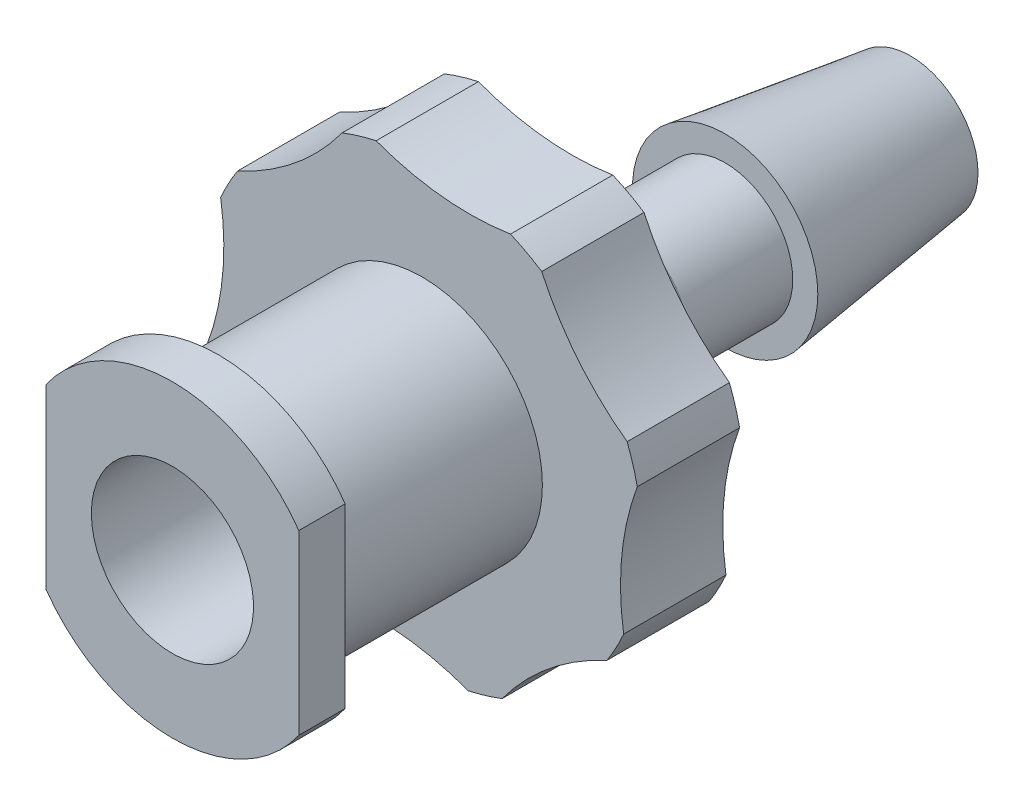
ISO-10303-21;
HEADER;
FILE_DESCRIPTION(('STEP AP214'),'2;1');
FILE_NAME('part.step','',(''),(''),'','','');
FILE_SCHEMA(('AUTOMOTIVE_DESIGN { 1 0 10303 214 1 1 1 1 }'));
ENDSEC;
DATA;
#1=APPLICATION_CONTEXT('core data for automotive mechanical design processes');
#2=APPLICATION_PROTOCOL_DEFINITION('international standard','automotive_design',2000,#1);
#3=PRODUCT_CONTEXT('',#1,'mechanical');
#4=PRODUCT('Part','Part','',(#3));
#5=PRODUCT_RELATED_PRODUCT_CATEGORY('part','',(#4));
#6=PRODUCT_DEFINITION_FORMATION('','',#4);
#7=PRODUCT_DEFINITION_CONTEXT('part definition',#1,'design');
#8=PRODUCT_DEFINITION('design','',#6,#7);
#9=PRODUCT_DEFINITION_SHAPE('','',#8);
#10=(LENGTH_UNIT() NAMED_UNIT(*) SI_UNIT(.MILLI.,.METRE.));
#11=(NAMED_UNIT(*) PLANE_ANGLE_UNIT() SI_UNIT($,.RADIAN.));
#12=(NAMED_UNIT(*) SI_UNIT($,.STERADIAN.) SOLID_ANGLE_UNIT());
#13=UNCERTAINTY_MEASURE_WITH_UNIT(LENGTH_MEASURE(1.E-05),#10,'distance_accuracy_value','');
#14=(GEOMETRIC_REPRESENTATION_CONTEXT(3) GLOBAL_UNCERTAINTY_ASSIGNED_CONTEXT((#13)) GLOBAL_UNIT_ASSIGNED_CONTEXT((#10,
#11,#12)) REPRESENTATION_CONTEXT('',''));
#15=CARTESIAN_POINT('',(0.,0.,0.));
#16=DIRECTION('',(0.,0.,1.));
#17=DIRECTION('',(1.,0.,0.));
#18=AXIS2_PLACEMENT_3D('',#15,#16,#17);
#19=CARTESIAN_POINT('',(0.,0.,0.));
#20=DIRECTION('',(0.,0.,1.));
#21=DIRECTION('',(1.,0.,0.));
#22=AXIS2_PLACEMENT_3D('',#19,#20,#21);
#23=PLANE('',#22);
#24=CARTESIAN_POINT('',(0.,0.,0.));
#25=DIRECTION('',(0.,0.,1.));
#26=DIRECTION('',(1.,0.,0.));
#27=AXIS2_PLACEMENT_3D('',#24,#25,#26);
#28=CIRCLE('',#27,1.215);
#29=CARTESIAN_POINT('',(1.215,0.,0.));
#30=VERTEX_POINT('',#29);
#31=EDGE_CURVE('E301',#30,#30,#28,.T.);
#32=ORIENTED_EDGE('',*,*,#31,.T.);
#33=EDGE_LOOP('',(#32));
#34=FACE_BOUND('',#33,.T.);
#35=CARTESIAN_POINT('',(0.,0.,0.));
#36=DIRECTION('',(0.,0.,1.));
#37=DIRECTION('',(1.,0.,0.));
#38=AXIS2_PLACEMENT_3D('',#35,#36,#37);
#39=CIRCLE('',#38,1.74999999999592);
#40=CARTESIAN_POINT('',(1.74999999999592,0.,0.));
#41=VERTEX_POINT('',#40);
#42=EDGE_CURVE('E23',#41,#41,#39,.T.);
#43=ORIENTED_EDGE('',*,*,#42,.F.);
#44=EDGE_LOOP('',(#43));
#45=FACE_BOUND('',#44,.T.);
#46=ADVANCED_FACE('F20',(#34,#45),#23,.F.);
#47=CARTESIAN_POINT('',(0.,0.,4.79999999981828));
#48=DIRECTION('',(0.,0.,1.));
#49=DIRECTION('',(1.,0.,0.));
#50=AXIS2_PLACEMENT_3D('',#47,#48,#49);
#51=CONICAL_SURFACE('',#50,2.39999999996598,0.134597914159376);
#52=ORIENTED_EDGE('',*,*,#42,.T.);
#53=EDGE_LOOP('',(#52));
#54=FACE_BOUND('',#53,.T.);
#55=CARTESIAN_POINT('',(0.,0.,4.79999999998881));
#56=DIRECTION('',(0.,0.,1.));
#57=DIRECTION('',(1.,0.,0.));
#58=AXIS2_PLACEMENT_3D('',#55,#56,#57);
#59=CIRCLE('',#58,2.39999999998908);
#60=CARTESIAN_POINT('',(2.39999999998908,0.,4.79999999998881));
#61=VERTEX_POINT('',#60);
#62=EDGE_CURVE('E306',#61,#61,#59,.F.);
#63=ORIENTED_EDGE('',*,*,#62,.T.);
#64=EDGE_LOOP('',(#63));
#65=FACE_BOUND('',#64,.T.);
#66=ADVANCED_FACE('F373',(#54,#65),#51,.T.);
#67=CARTESIAN_POINT('',(0.,0.,0.));
#68=DIRECTION('',(0.,0.,1.));
#69=DIRECTION('',(1.,0.,0.));
#70=AXIS2_PLACEMENT_3D('',#67,#68,#69);
#71=CYLINDRICAL_SURFACE('',#70,1.215);
#72=ORIENTED_EDGE('',*,*,#31,.F.);
#73=EDGE_LOOP('',(#72));
#74=FACE_BOUND('',#73,.T.);
#75=CARTESIAN_POINT('',(0.,0.,11.62));
#76=DIRECTION('',(0.,0.,1.));
#77=DIRECTION('',(1.,0.,0.));
#78=AXIS2_PLACEMENT_3D('',#75,#76,#77);
#79=CIRCLE('',#78,1.215);
#80=CARTESIAN_POINT('',(1.215,0.,11.62));
#81=VERTEX_POINT('',#80);
#82=EDGE_CURVE('E310',#81,#81,#79,.F.);
#83=ORIENTED_EDGE('',*,*,#82,.F.);
#84=EDGE_LOOP('',(#83));
#85=FACE_BOUND('',#84,.T.);
#86=ADVANCED_FACE('F382',(#74,#85),#71,.F.);
#87=CARTESIAN_POINT('',(0.,0.,4.8));
#88=DIRECTION('',(0.,0.,-1.));
#89=DIRECTION('',(-1.,0.,0.));
#90=AXIS2_PLACEMENT_3D('',#87,#88,#89);
#91=PLANE('',#90);
#92=CARTESIAN_POINT('',(0.,0.,4.8));
#93=DIRECTION('',(0.,0.,1.));
#94=DIRECTION('',(1.,0.,0.));
#95=AXIS2_PLACEMENT_3D('',#92,#93,#94);
#96=CIRCLE('',#95,1.75);
#97=CARTESIAN_POINT('',(1.75,0.,4.8));
#98=VERTEX_POINT('',#97);
#99=EDGE_CURVE('E313',#98,#98,#96,.T.);
#100=ORIENTED_EDGE('',*,*,#99,.F.);
#101=EDGE_LOOP('',(#100));
#102=FACE_BOUND('',#101,.T.);
#103=ORIENTED_EDGE('',*,*,#62,.F.);
#104=EDGE_LOOP('',(#103));
#105=FACE_BOUND('',#104,.T.);
#106=ADVANCED_FACE('F494',(#102,#105),#91,.F.);
#107=CARTESIAN_POINT('',(0.,0.,11.62));
#108=DIRECTION('',(0.,0.,1.));
#109=DIRECTION('',(1.,0.,0.));
#110=AXIS2_PLACEMENT_3D('',#107,#108,#109);
#111=PLANE('',#110);
#112=ORIENTED_EDGE('',*,*,#82,.T.);
#113=EDGE_LOOP('',(#112));
#114=FACE_BOUND('',#113,.T.);
#115=CARTESIAN_POINT('',(0.,0.,11.62));
#116=DIRECTION('',(0.,0.,-1.));
#117=DIRECTION('',(-1.,0.,0.));
#118=AXIS2_PLACEMENT_3D('',#115,#116,#117);
#119=CIRCLE('',#118,2.1);
#120=CARTESIAN_POINT('',(-2.1,0.,11.62));
#121=VERTEX_POINT('',#120);
#122=EDGE_CURVE('E290',#121,#121,#119,.F.);
#123=ORIENTED_EDGE('',*,*,#122,.T.);
#124=EDGE_LOOP('',(#123));
#125=FACE_BOUND('',#124,.T.);
#126=ADVANCED_FACE('F490',(#114,#125),#111,.T.);
#127=CARTESIAN_POINT('',(0.,0.,0.));
#128=DIRECTION('',(0.,0.,1.));
#129=DIRECTION('',(1.,0.,0.));
#130=AXIS2_PLACEMENT_3D('',#127,#128,#129);
#131=CYLINDRICAL_SURFACE('',#130,1.75);
#132=ORIENTED_EDGE('',*,*,#99,.T.);
#133=EDGE_LOOP('',(#132));
#134=FACE_BOUND('',#133,.T.);
#135=CARTESIAN_POINT('',(0.,0.,7.49999999999318));
#136=DIRECTION('',(0.,0.,1.));
#137=DIRECTION('',(1.,0.,0.));
#138=AXIS2_PLACEMENT_3D('',#135,#136,#137);
#139=CIRCLE('',#138,1.75000000001546);
#140=CARTESIAN_POINT('',(1.75000000001546,0.,7.49999999999318));
#141=VERTEX_POINT('',#140);
#142=EDGE_CURVE('E285',#141,#141,#139,.T.);
#143=ORIENTED_EDGE('',*,*,#142,.F.);
#144=EDGE_LOOP('',(#143));
#145=FACE_BOUND('',#144,.T.);
#146=ADVANCED_FACE('F486',(#134,#145),#131,.T.);
#147=CARTESIAN_POINT('',(0.,0.,19.12));
#148=DIRECTION('',(0.,0.,-1.));
#149=DIRECTION('',(-1.,0.,0.));
#150=AXIS2_PLACEMENT_3D('',#147,#148,#149);
#151=CYLINDRICAL_SURFACE('',#150,2.1);
#152=CARTESIAN_POINT('',(0.,0.,19.12));
#153=DIRECTION('',(0.,0.,-1.));
#154=DIRECTION('',(-1.,0.,0.));
#155=AXIS2_PLACEMENT_3D('',#152,#153,#154);
#156=CIRCLE('',#155,2.1);
#157=CARTESIAN_POINT('',(-2.1,0.,19.12));
#158=VERTEX_POINT('',#157);
#159=EDGE_CURVE('E289',#158,#158,#156,.T.);
#160=ORIENTED_EDGE('',*,*,#159,.F.);
#161=EDGE_LOOP('',(#160));
#162=FACE_BOUND('',#161,.T.);
#163=ORIENTED_EDGE('',*,*,#122,.F.);
#164=EDGE_LOOP('',(#163));
#165=FACE_BOUND('',#164,.T.);
#166=ADVANCED_FACE('F482',(#162,#165),#151,.F.);
#167=CARTESIAN_POINT('',(0.,0.,9.99999999999091));
#168=DIRECTION('',(0.,0.,1.));
#169=DIRECTION('',(1.,0.,0.));
#170=AXIS2_PLACEMENT_3D('',#167,#168,#169);
#171=CONICAL_SURFACE('',#170,2.35000000002117,0.235544980723228);
#172=ORIENTED_EDGE('',*,*,#142,.T.);
#173=EDGE_LOOP('',(#172));
#174=FACE_BOUND('',#173,.T.);
#175=CARTESIAN_POINT('',(0.,0.,9.99999999999091));
#176=DIRECTION('',(0.,0.,1.));
#177=DIRECTION('',(1.,0.,0.));
#178=AXIS2_PLACEMENT_3D('',#175,#176,#177);
#179=CIRCLE('',#178,2.35000000002117);
#180=CARTESIAN_POINT('',(2.35000000002117,0.,9.99999999999091));
#181=VERTEX_POINT('',#180);
#182=EDGE_CURVE('E334',#181,#181,#179,.F.);
#183=ORIENTED_EDGE('',*,*,#182,.T.);
#184=EDGE_LOOP('',(#183));
#185=FACE_BOUND('',#184,.T.);
#186=ADVANCED_FACE('F478',(#174,#185),#171,.T.);
#187=CARTESIAN_POINT('',(0.,0.,19.12));
#188=DIRECTION('',(0.,0.,1.));
#189=DIRECTION('',(1.,0.,0.));
#190=AXIS2_PLACEMENT_3D('',#187,#188,#189);
#191=PLANE('',#190);
#192=ORIENTED_EDGE('',*,*,#159,.T.);
#193=EDGE_LOOP('',(#192));
#194=FACE_BOUND('',#193,.T.);
#195=DIRECTION('',(0.,1.,0.));
#196=VECTOR('',#195,1.);
#197=CARTESIAN_POINT('',(-3.275,2.29660074893308,19.12));
#198=LINE('',#197,#196);
#199=CARTESIAN_POINT('',(-3.275,2.29660074893308,19.12));
#200=VERTEX_POINT('',#199);
#201=CARTESIAN_POINT('',(-3.275,-2.29660074893308,19.12));
#202=VERTEX_POINT('',#201);
#203=EDGE_CURVE('E273',#200,#202,#198,.F.);
#204=ORIENTED_EDGE('',*,*,#203,.T.);
#205=CARTESIAN_POINT('',(0.,0.,19.12));
#206=DIRECTION('',(0.,0.,1.));
#207=DIRECTION('',(1.,0.,0.));
#208=AXIS2_PLACEMENT_3D('',#205,#206,#207);
#209=CIRCLE('',#208,4.);
#210=CARTESIAN_POINT('',(3.275,-2.29660074893309,19.12));
#211=VERTEX_POINT('',#210);
#212=EDGE_CURVE('E284',#211,#202,#209,.F.);
#213=ORIENTED_EDGE('',*,*,#212,.F.);
#214=DIRECTION('',(0.,-1.,0.));
#215=VECTOR('',#214,1.);
#216=CARTESIAN_POINT('',(3.275,-2.29660074893309,19.12));
#217=LINE('',#216,#215);
#218=CARTESIAN_POINT('',(3.275,2.29660074893308,19.12));
#219=VERTEX_POINT('',#218);
#220=EDGE_CURVE('E277',#211,#219,#217,.F.);
#221=ORIENTED_EDGE('',*,*,#220,.T.);
#222=CARTESIAN_POINT('',(0.,0.,19.12));
#223=DIRECTION('',(0.,0.,1.));
#224=DIRECTION('',(1.,0.,0.));
#225=AXIS2_PLACEMENT_3D('',#222,#223,#224);
#226=CIRCLE('',#225,4.);
#227=EDGE_CURVE('E274',#200,#219,#226,.F.);
#228=ORIENTED_EDGE('',*,*,#227,.F.);
#229=EDGE_LOOP('',(#204,#213,#221,#228));
#230=FACE_BOUND('',#229,.T.);
#231=ADVANCED_FACE('F475',(#194,#230),#191,.T.);
#232=CARTESIAN_POINT('',(0.,0.,10.));
#233=DIRECTION('',(0.,0.,1.));
#234=DIRECTION('',(1.,0.,0.));
#235=AXIS2_PLACEMENT_3D('',#232,#233,#234);
#236=CYLINDRICAL_SURFACE('',#235,5.7);
#237=DIRECTION('',(0.,0.,1.));
#238=VECTOR('',#237,1.);
#239=CARTESIAN_POINT('',(2.07266928245262,-5.3098062154448,10.));
#240=LINE('',#239,#238);
#241=CARTESIAN_POINT('',(2.07266928245257,-5.30980621544487,10.));
#242=VERTEX_POINT('',#241);
#243=CARTESIAN_POINT('',(2.07266928245257,-5.30980621544487,12.65));
#244=VERTEX_POINT('',#243);
#245=EDGE_CURVE('E172',#242,#244,#240,.T.);
#246=ORIENTED_EDGE('',*,*,#245,.T.);
#247=CARTESIAN_POINT('',(0.,0.,12.65));
#248=DIRECTION('',(0.,0.,1.));
#249=DIRECTION('',(1.,0.,0.));
#250=AXIS2_PLACEMENT_3D('',#247,#248,#249);
#251=CIRCLE('',#250,5.7);
#252=CARTESIAN_POINT('',(1.19309733414147,-5.57373472200319,12.65));
#253=VERTEX_POINT('',#252);
#254=EDGE_CURVE('E84',#244,#253,#251,.F.);
#255=ORIENTED_EDGE('',*,*,#254,.T.);
#256=DIRECTION('',(0.,0.,1.));
#257=VECTOR('',#256,1.);
#258=CARTESIAN_POINT('',(1.19309733414139,-5.57373472200316,10.));
#259=LINE('',#258,#257);
#260=CARTESIAN_POINT('',(1.19309733414147,-5.57373472200319,10.));
#261=VERTEX_POINT('',#260);
#262=EDGE_CURVE('E174',#253,#261,#259,.F.);
#263=ORIENTED_EDGE('',*,*,#262,.T.);
#264=CARTESIAN_POINT('',(0.,0.,10.));
#265=DIRECTION('',(0.,0.,1.));
#266=DIRECTION('',(1.,0.,0.));
#267=AXIS2_PLACEMENT_3D('',#264,#265,#266);
#268=CIRCLE('',#267,5.7);
#269=EDGE_CURVE('E168',#261,#242,#268,.T.);
#270=ORIENTED_EDGE('',*,*,#269,.T.);
#271=EDGE_LOOP('',(#246,#255,#263,#270));
#272=FACE_BOUND('',#271,.T.);
#273=ADVANCED_FACE('F170',(#272),#236,.T.);
#274=CARTESIAN_POINT('',(0.,0.,10.));
#275=DIRECTION('',(0.,0.,1.));
#276=DIRECTION('',(1.,0.,0.));
#277=AXIS2_PLACEMENT_3D('',#274,#275,#276);
#278=CYLINDRICAL_SURFACE('',#277,5.7);
#279=DIRECTION('',(0.,0.,1.));
#280=VECTOR('',#279,1.);
#281=CARTESIAN_POINT('',(4.78487283405032,-3.09757840287638,10.));
#282=LINE('',#281,#280);
#283=CARTESIAN_POINT('',(4.7848728340504,-3.09757840287634,12.65));
#284=VERTEX_POINT('',#283);
#285=CARTESIAN_POINT('',(4.7848728340504,-3.09757840287634,10.));
#286=VERTEX_POINT('',#285);
#287=EDGE_CURVE('E190',#284,#286,#282,.F.);
#288=ORIENTED_EDGE('',*,*,#287,.T.);
#289=CARTESIAN_POINT('',(0.,0.,10.));
#290=DIRECTION('',(0.,0.,1.));
#291=DIRECTION('',(1.,0.,0.));
#292=AXIS2_PLACEMENT_3D('',#289,#290,#291);
#293=CIRCLE('',#292,5.7);
#294=CARTESIAN_POINT('',(5.22019848650682,-2.28900147694827,10.));
#295=VERTEX_POINT('',#294);
#296=EDGE_CURVE('E179',#286,#295,#293,.T.);
#297=ORIENTED_EDGE('',*,*,#296,.T.);
#298=DIRECTION('',(0.,0.,1.));
#299=VECTOR('',#298,1.);
#300=CARTESIAN_POINT('',(5.2201984865068,-2.28900147694819,10.));
#301=LINE('',#300,#299);
#302=CARTESIAN_POINT('',(5.22019848650682,-2.28900147694827,12.65));
#303=VERTEX_POINT('',#302);
#304=EDGE_CURVE('E224',#295,#303,#301,.T.);
#305=ORIENTED_EDGE('',*,*,#304,.T.);
#306=CARTESIAN_POINT('',(0.,0.,12.65));
#307=DIRECTION('',(0.,0.,1.));
#308=DIRECTION('',(1.,0.,0.));
#309=AXIS2_PLACEMENT_3D('',#306,#307,#308);
#310=CIRCLE('',#309,5.7);
#311=EDGE_CURVE('E363',#303,#284,#310,.F.);
#312=ORIENTED_EDGE('',*,*,#311,.T.);
#313=EDGE_LOOP('',(#288,#297,#305,#312));
#314=FACE_BOUND('',#313,.T.);
#315=ADVANCED_FACE('F469',(#314),#278,.T.);
#316=CARTESIAN_POINT('',(0.,0.,10.));
#317=DIRECTION('',(0.,0.,1.));
#318=DIRECTION('',(1.,0.,0.));
#319=AXIS2_PLACEMENT_3D('',#316,#317,#318);
#320=CYLINDRICAL_SURFACE('',#319,5.7);
#321=DIRECTION('',(0.,0.,1.));
#322=VECTOR('',#321,1.);
#323=CARTESIAN_POINT('',(5.3098062154448,2.07266928245263,10.));
#324=LINE('',#323,#322);
#325=CARTESIAN_POINT('',(5.30980621544487,2.07266928245257,10.));
#326=VERTEX_POINT('',#325);
#327=CARTESIAN_POINT('',(5.30980621544487,2.07266928245257,12.65));
#328=VERTEX_POINT('',#327);
#329=EDGE_CURVE('E213',#326,#328,#324,.T.);
#330=ORIENTED_EDGE('',*,*,#329,.T.);
#331=CARTESIAN_POINT('',(0.,0.,12.65));
#332=DIRECTION('',(0.,0.,1.));
#333=DIRECTION('',(1.,0.,0.));
#334=AXIS2_PLACEMENT_3D('',#331,#332,#333);
#335=CIRCLE('',#334,5.7);
#336=CARTESIAN_POINT('',(5.57373472200319,1.19309733414147,12.65));
#337=VERTEX_POINT('',#336);
#338=EDGE_CURVE('E361',#328,#337,#335,.F.);
#339=ORIENTED_EDGE('',*,*,#338,.T.);
#340=DIRECTION('',(0.,0.,1.));
#341=VECTOR('',#340,1.);
#342=CARTESIAN_POINT('',(5.57373472200316,1.19309733414139,10.));
#343=LINE('',#342,#341);
#344=CARTESIAN_POINT('',(5.57373472200319,1.19309733414147,10.));
#345=VERTEX_POINT('',#344);
#346=EDGE_CURVE('E195',#337,#345,#343,.F.);
#347=ORIENTED_EDGE('',*,*,#346,.T.);
#348=CARTESIAN_POINT('',(0.,0.,10.));
#349=DIRECTION('',(0.,0.,1.));
#350=DIRECTION('',(1.,0.,0.));
#351=AXIS2_PLACEMENT_3D('',#348,#349,#350);
#352=CIRCLE('',#351,5.7);
#353=EDGE_CURVE('E345',#345,#326,#352,.T.);
#354=ORIENTED_EDGE('',*,*,#353,.T.);
#355=EDGE_LOOP('',(#330,#339,#347,#354));
#356=FACE_BOUND('',#355,.T.);
#357=ADVANCED_FACE('F465',(#356),#320,.T.);
#358=CARTESIAN_POINT('',(0.,0.,10.));
#359=DIRECTION('',(0.,0.,1.));
#360=DIRECTION('',(1.,0.,0.));
#361=AXIS2_PLACEMENT_3D('',#358,#359,#360);
#362=CYLINDRICAL_SURFACE('',#361,5.7);
#363=DIRECTION('',(0.,0.,1.));
#364=VECTOR('',#363,1.);
#365=CARTESIAN_POINT('',(3.09757840287637,4.78487283405032,10.));
#366=LINE('',#365,#364);
#367=CARTESIAN_POINT('',(3.09757840287634,4.7848728340504,12.65));
#368=VERTEX_POINT('',#367);
#369=CARTESIAN_POINT('',(3.09757840287634,4.7848728340504,10.));
#370=VERTEX_POINT('',#369);
#371=EDGE_CURVE('E222',#368,#370,#366,.F.);
#372=ORIENTED_EDGE('',*,*,#371,.T.);
#373=CARTESIAN_POINT('',(0.,0.,10.));
#374=DIRECTION('',(0.,0.,1.));
#375=DIRECTION('',(1.,0.,0.));
#376=AXIS2_PLACEMENT_3D('',#373,#374,#375);
#377=CIRCLE('',#376,5.7);
#378=CARTESIAN_POINT('',(2.28900147694827,5.22019848650682,10.));
#379=VERTEX_POINT('',#378);
#380=EDGE_CURVE('E342',#370,#379,#377,.T.);
#381=ORIENTED_EDGE('',*,*,#380,.T.);
#382=DIRECTION('',(0.,0.,1.));
#383=VECTOR('',#382,1.);
#384=CARTESIAN_POINT('',(2.28900147694819,5.2201984865068,10.));
#385=LINE('',#384,#383);
#386=CARTESIAN_POINT('',(2.28900147694827,5.22019848650682,12.65));
#387=VERTEX_POINT('',#386);
#388=EDGE_CURVE('E231',#379,#387,#385,.T.);
#389=ORIENTED_EDGE('',*,*,#388,.T.);
#390=CARTESIAN_POINT('',(0.,0.,12.65));
#391=DIRECTION('',(0.,0.,1.));
#392=DIRECTION('',(1.,0.,0.));
#393=AXIS2_PLACEMENT_3D('',#390,#391,#392);
#394=CIRCLE('',#393,5.7);
#395=EDGE_CURVE('E358',#387,#368,#394,.F.);
#396=ORIENTED_EDGE('',*,*,#395,.T.);
#397=EDGE_LOOP('',(#372,#381,#389,#396));
#398=FACE_BOUND('',#397,.T.);
#399=ADVANCED_FACE('F461',(#398),#362,.T.);
#400=CARTESIAN_POINT('',(0.,0.,10.));
#401=DIRECTION('',(0.,0.,1.));
#402=DIRECTION('',(1.,0.,0.));
#403=AXIS2_PLACEMENT_3D('',#400,#401,#402);
#404=CYLINDRICAL_SURFACE('',#403,5.7);
#405=DIRECTION('',(0.,0.,1.));
#406=VECTOR('',#405,1.);
#407=CARTESIAN_POINT('',(-2.07266928245263,5.3098062154448,10.));
#408=LINE('',#407,#406);
#409=CARTESIAN_POINT('',(-2.07266928245257,5.30980621544487,10.));
#410=VERTEX_POINT('',#409);
#411=CARTESIAN_POINT('',(-2.07266928245257,5.30980621544487,12.65));
#412=VERTEX_POINT('',#411);
#413=EDGE_CURVE('E240',#410,#412,#408,.T.);
#414=ORIENTED_EDGE('',*,*,#413,.T.);
#415=CARTESIAN_POINT('',(0.,0.,12.65));
#416=DIRECTION('',(0.,0.,1.));
#417=DIRECTION('',(1.,0.,0.));
#418=AXIS2_PLACEMENT_3D('',#415,#416,#417);
#419=CIRCLE('',#418,5.7);
#420=CARTESIAN_POINT('',(-1.19309733414147,5.57373472200319,12.65));
#421=VERTEX_POINT('',#420);
#422=EDGE_CURVE('E355',#412,#421,#419,.F.);
#423=ORIENTED_EDGE('',*,*,#422,.T.);
#424=DIRECTION('',(0.,0.,1.));
#425=VECTOR('',#424,1.);
#426=CARTESIAN_POINT('',(-1.19309733414139,5.57373472200316,10.));
#427=LINE('',#426,#425);
#428=CARTESIAN_POINT('',(-1.19309733414147,5.57373472200319,10.));
#429=VERTEX_POINT('',#428);
#430=EDGE_CURVE('E219',#421,#429,#427,.F.);
#431=ORIENTED_EDGE('',*,*,#430,.T.);
#432=CARTESIAN_POINT('',(0.,0.,10.));
#433=DIRECTION('',(0.,0.,1.));
#434=DIRECTION('',(1.,0.,0.));
#435=AXIS2_PLACEMENT_3D('',#432,#433,#434);
#436=CIRCLE('',#435,5.7);
#437=EDGE_CURVE('E339',#429,#410,#436,.T.);
#438=ORIENTED_EDGE('',*,*,#437,.T.);
#439=EDGE_LOOP('',(#414,#423,#431,#438));
#440=FACE_BOUND('',#439,.T.);
#441=ADVANCED_FACE('F457',(#440),#404,.T.);
#442=CARTESIAN_POINT('',(0.,0.,10.));
#443=DIRECTION('',(0.,0.,1.));
#444=DIRECTION('',(1.,0.,0.));
#445=AXIS2_PLACEMENT_3D('',#442,#443,#444);
#446=CYLINDRICAL_SURFACE('',#445,5.7);
#447=DIRECTION('',(0.,0.,1.));
#448=VECTOR('',#447,1.);
#449=CARTESIAN_POINT('',(-4.78487283405032,3.09757840287637,10.));
#450=LINE('',#449,#448);
#451=CARTESIAN_POINT('',(-4.7848728340504,3.09757840287634,12.65));
#452=VERTEX_POINT('',#451);
#453=CARTESIAN_POINT('',(-4.7848728340504,3.09757840287634,10.));
#454=VERTEX_POINT('',#453);
#455=EDGE_CURVE('E236',#452,#454,#450,.F.);
#456=ORIENTED_EDGE('',*,*,#455,.T.);
#457=CARTESIAN_POINT('',(0.,0.,10.));
#458=DIRECTION('',(0.,0.,1.));
#459=DIRECTION('',(1.,0.,0.));
#460=AXIS2_PLACEMENT_3D('',#457,#458,#459);
#461=CIRCLE('',#460,5.7);
#462=CARTESIAN_POINT('',(-5.22019848650682,2.28900147694828,10.));
#463=VERTEX_POINT('',#462);
#464=EDGE_CURVE('E335',#454,#463,#461,.T.);
#465=ORIENTED_EDGE('',*,*,#464,.T.);
#466=DIRECTION('',(0.,0.,1.));
#467=VECTOR('',#466,1.);
#468=CARTESIAN_POINT('',(-5.22019848650681,2.28900147694819,10.));
#469=LINE('',#468,#467);
#470=CARTESIAN_POINT('',(-5.22019848650682,2.28900147694828,12.65));
#471=VERTEX_POINT('',#470);
#472=EDGE_CURVE('E249',#463,#471,#469,.T.);
#473=ORIENTED_EDGE('',*,*,#472,.T.);
#474=CARTESIAN_POINT('',(0.,0.,12.65));
#475=DIRECTION('',(0.,0.,1.));
#476=DIRECTION('',(1.,0.,0.));
#477=AXIS2_PLACEMENT_3D('',#474,#475,#476);
#478=CIRCLE('',#477,5.7);
#479=EDGE_CURVE('E352',#471,#452,#478,.F.);
#480=ORIENTED_EDGE('',*,*,#479,.T.);
#481=EDGE_LOOP('',(#456,#465,#473,#480));
#482=FACE_BOUND('',#481,.T.);
#483=ADVANCED_FACE('F454',(#482),#446,.T.);
#484=CARTESIAN_POINT('',(0.,0.,10.));
#485=DIRECTION('',(0.,0.,1.));
#486=DIRECTION('',(1.,0.,0.));
#487=AXIS2_PLACEMENT_3D('',#484,#485,#486);
#488=CYLINDRICAL_SURFACE('',#487,5.7);
#489=DIRECTION('',(0.,0.,1.));
#490=VECTOR('',#489,1.);
#491=CARTESIAN_POINT('',(-3.09757840287637,-4.78487283405032,10.));
#492=LINE('',#491,#490);
#493=CARTESIAN_POINT('',(-3.09757840287633,-4.7848728340504,12.65));
#494=VERTEX_POINT('',#493);
#495=CARTESIAN_POINT('',(-3.09757840287633,-4.7848728340504,10.));
#496=VERTEX_POINT('',#495);
#497=EDGE_CURVE('E254',#494,#496,#492,.F.);
#498=ORIENTED_EDGE('',*,*,#497,.T.);
#499=CARTESIAN_POINT('',(0.,0.,10.));
#500=DIRECTION('',(0.,0.,1.));
#501=DIRECTION('',(1.,0.,0.));
#502=AXIS2_PLACEMENT_3D('',#499,#500,#501);
#503=CIRCLE('',#502,5.7);
#504=CARTESIAN_POINT('',(-2.28900147694828,-5.22019848650682,10.));
#505=VERTEX_POINT('',#504);
#506=EDGE_CURVE('E329',#496,#505,#503,.T.);
#507=ORIENTED_EDGE('',*,*,#506,.T.);
#508=DIRECTION('',(0.,0.,1.));
#509=VECTOR('',#508,1.);
#510=CARTESIAN_POINT('',(-2.28900147694819,-5.2201984865068,10.));
#511=LINE('',#510,#509);
#512=CARTESIAN_POINT('',(-2.28900147694828,-5.22019848650682,12.65));
#513=VERTEX_POINT('',#512);
#514=EDGE_CURVE('E769',#505,#513,#511,.T.);
#515=ORIENTED_EDGE('',*,*,#514,.T.);
#516=CARTESIAN_POINT('',(0.,0.,12.65));
#517=DIRECTION('',(0.,0.,1.));
#518=DIRECTION('',(1.,0.,0.));
#519=AXIS2_PLACEMENT_3D('',#516,#517,#518);
#520=CIRCLE('',#519,5.7);
#521=EDGE_CURVE('E40',#513,#494,#520,.F.);
#522=ORIENTED_EDGE('',*,*,#521,.T.);
#523=EDGE_LOOP('',(#498,#507,#515,#522));
#524=FACE_BOUND('',#523,.T.);
#525=ADVANCED_FACE('F450',(#524),#488,.T.);
#526=CARTESIAN_POINT('',(0.,0.,10.));
#527=DIRECTION('',(0.,0.,1.));
#528=DIRECTION('',(1.,0.,0.));
#529=AXIS2_PLACEMENT_3D('',#526,#527,#528);
#530=PLANE('',#529);
#531=ORIENTED_EDGE('',*,*,#182,.F.);
#532=EDGE_LOOP('',(#531));
#533=FACE_BOUND('',#532,.T.);
#534=ORIENTED_EDGE('',*,*,#506,.F.);
#535=CARTESIAN_POINT('',(-9.3971147015417,-7.66482238709559,10.));
#536=DIRECTION('',(0.,0.,1.));
#537=DIRECTION('',(1.,0.,0.));
#538=AXIS2_PLACEMENT_3D('',#535,#536,#537);
#539=CIRCLE('',#538,6.92663460897771);
#540=CARTESIAN_POINT('',(-5.30980621544487,-2.07266928245256,10.));
#541=VERTEX_POINT('',#540);
#542=EDGE_CURVE('E257',#496,#541,#539,.T.);
#543=ORIENTED_EDGE('',*,*,#542,.T.);
#544=CARTESIAN_POINT('',(0.,0.,10.));
#545=DIRECTION('',(0.,0.,1.));
#546=DIRECTION('',(1.,0.,0.));
#547=AXIS2_PLACEMENT_3D('',#544,#545,#546);
#548=CIRCLE('',#547,5.7);
#549=CARTESIAN_POINT('',(-5.57373472200322,-1.19309733414156,10.));
#550=VERTEX_POINT('',#549);
#551=EDGE_CURVE('E753',#550,#541,#548,.T.);
#552=ORIENTED_EDGE('',*,*,#551,.F.);
#553=CARTESIAN_POINT('',(-12.0646114155537,1.22491564254219,10.));
#554=DIRECTION('',(0.,0.,1.));
#555=DIRECTION('',(1.,0.,0.));
#556=AXIS2_PLACEMENT_3D('',#553,#554,#555);
#557=CIRCLE('',#556,6.92663460897771);
#558=EDGE_CURVE('E248',#550,#463,#557,.T.);
#559=ORIENTED_EDGE('',*,*,#558,.T.);
#560=ORIENTED_EDGE('',*,*,#464,.F.);
#561=CARTESIAN_POINT('',(-7.66482238709559,9.39711470154171,10.));
#562=DIRECTION('',(0.,0.,1.));
#563=DIRECTION('',(1.,0.,0.));
#564=AXIS2_PLACEMENT_3D('',#561,#562,#563);
#565=CIRCLE('',#564,6.92663460897771);
#566=EDGE_CURVE('E239',#454,#410,#565,.T.);
#567=ORIENTED_EDGE('',*,*,#566,.T.);
#568=ORIENTED_EDGE('',*,*,#437,.F.);
#569=CARTESIAN_POINT('',(1.22491564254219,12.0646114155537,10.));
#570=DIRECTION('',(0.,0.,1.));
#571=DIRECTION('',(1.,0.,0.));
#572=AXIS2_PLACEMENT_3D('',#569,#570,#571);
#573=CIRCLE('',#572,6.92663460897771);
#574=EDGE_CURVE('E237',#429,#379,#573,.T.);
#575=ORIENTED_EDGE('',*,*,#574,.T.);
#576=ORIENTED_EDGE('',*,*,#380,.F.);
#577=CARTESIAN_POINT('',(9.39711470154171,7.66482238709559,10.));
#578=DIRECTION('',(0.,0.,1.));
#579=DIRECTION('',(1.,0.,0.));
#580=AXIS2_PLACEMENT_3D('',#577,#578,#579);
#581=CIRCLE('',#580,6.92663460897771);
#582=EDGE_CURVE('E220',#370,#326,#581,.T.);
#583=ORIENTED_EDGE('',*,*,#582,.T.);
#584=ORIENTED_EDGE('',*,*,#353,.F.);
#585=CARTESIAN_POINT('',(12.0646114155537,-1.22491564254219,10.));
#586=DIRECTION('',(0.,0.,1.));
#587=DIRECTION('',(1.,0.,0.));
#588=AXIS2_PLACEMENT_3D('',#585,#586,#587);
#589=CIRCLE('',#588,6.92663460897771);
#590=EDGE_CURVE('E199',#345,#295,#589,.T.);
#591=ORIENTED_EDGE('',*,*,#590,.T.);
#592=ORIENTED_EDGE('',*,*,#296,.F.);
#593=CARTESIAN_POINT('',(7.66482238709559,-9.39711470154171,10.));
#594=DIRECTION('',(0.,0.,1.));
#595=DIRECTION('',(1.,0.,0.));
#596=AXIS2_PLACEMENT_3D('',#593,#594,#595);
#597=CIRCLE('',#596,6.92663460897771);
#598=EDGE_CURVE('E183',#286,#242,#597,.T.);
#599=ORIENTED_EDGE('',*,*,#598,.T.);
#600=ORIENTED_EDGE('',*,*,#269,.F.);
#601=CARTESIAN_POINT('',(-1.22491564254219,-12.0646114155537,10.));
#602=DIRECTION('',(0.,0.,1.));
#603=DIRECTION('',(1.,0.,0.));
#604=AXIS2_PLACEMENT_3D('',#601,#602,#603);
#605=CIRCLE('',#604,6.92663460897771);
#606=EDGE_CURVE('E767',#261,#505,#605,.T.);
#607=ORIENTED_EDGE('',*,*,#606,.T.);
#608=EDGE_LOOP('',(#534,#543,#552,#559,#560,#567,#568,#575,#576,#583,#584,#591,#592,#599,#600,#607));
#609=FACE_BOUND('',#608,.T.);
#610=ADVANCED_FACE('F185',(#533,#609),#530,.F.);
#611=CARTESIAN_POINT('',(0.,0.,10.));
#612=DIRECTION('',(0.,0.,1.));
#613=DIRECTION('',(1.,0.,0.));
#614=AXIS2_PLACEMENT_3D('',#611,#612,#613);
#615=CYLINDRICAL_SURFACE('',#614,5.7);
#616=DIRECTION('',(0.,0.,1.));
#617=VECTOR('',#616,1.);
#618=CARTESIAN_POINT('',(-5.3098062154448,-2.07266928245262,10.));
#619=LINE('',#618,#617);
#620=CARTESIAN_POINT('',(-5.30980621544487,-2.07266928245256,12.65));
#621=VERTEX_POINT('',#620);
#622=EDGE_CURVE('E258',#541,#621,#619,.T.);
#623=ORIENTED_EDGE('',*,*,#622,.T.);
#624=CARTESIAN_POINT('',(0.,0.,12.65));
#625=DIRECTION('',(0.,0.,1.));
#626=DIRECTION('',(1.,0.,0.));
#627=AXIS2_PLACEMENT_3D('',#624,#625,#626);
#628=CIRCLE('',#627,5.7);
#629=CARTESIAN_POINT('',(-5.57373472200322,-1.19309733414156,12.65));
#630=VERTEX_POINT('',#629);
#631=EDGE_CURVE('E756',#621,#630,#628,.F.);
#632=ORIENTED_EDGE('',*,*,#631,.T.);
#633=DIRECTION('',(0.,0.,1.));
#634=VECTOR('',#633,1.);
#635=CARTESIAN_POINT('',(-5.57373472200322,-1.19309733414156,10.));
#636=LINE('',#635,#634);
#637=EDGE_CURVE('E245',#630,#550,#636,.F.);
#638=ORIENTED_EDGE('',*,*,#637,.T.);
#639=ORIENTED_EDGE('',*,*,#551,.T.);
#640=EDGE_LOOP('',(#623,#632,#638,#639));
#641=FACE_BOUND('',#640,.T.);
#642=ADVANCED_FACE('F443',(#641),#615,.T.);
#643=CARTESIAN_POINT('',(0.,0.,17.92));
#644=DIRECTION('',(0.,0.,1.));
#645=DIRECTION('',(1.,0.,0.));
#646=AXIS2_PLACEMENT_3D('',#643,#644,#645);
#647=CYLINDRICAL_SURFACE('',#646,4.);
#648=DIRECTION('',(0.,0.,1.));
#649=VECTOR('',#648,1.);
#650=CARTESIAN_POINT('',(-3.275,2.29660074893308,19.12));
#651=LINE('',#650,#649);
#652=CARTESIAN_POINT('',(-3.275,2.29660074893308,17.92));
#653=VERTEX_POINT('',#652);
#654=EDGE_CURVE('E267',#653,#200,#651,.T.);
#655=ORIENTED_EDGE('',*,*,#654,.T.);
#656=ORIENTED_EDGE('',*,*,#227,.T.);
#657=DIRECTION('',(0.,0.,1.));
#658=VECTOR('',#657,1.);
#659=CARTESIAN_POINT('',(3.275,2.29660074893308,19.12));
#660=LINE('',#659,#658);
#661=CARTESIAN_POINT('',(3.275,2.29660074893308,17.92));
#662=VERTEX_POINT('',#661);
#663=EDGE_CURVE('E280',#219,#662,#660,.F.);
#664=ORIENTED_EDGE('',*,*,#663,.T.);
#665=CARTESIAN_POINT('',(0.,0.,17.92));
#666=DIRECTION('',(0.,0.,1.));
#667=DIRECTION('',(1.,0.,0.));
#668=AXIS2_PLACEMENT_3D('',#665,#666,#667);
#669=CIRCLE('',#668,4.);
#670=EDGE_CURVE('E263',#662,#653,#669,.T.);
#671=ORIENTED_EDGE('',*,*,#670,.T.);
#672=EDGE_LOOP('',(#655,#656,#664,#671));
#673=FACE_BOUND('',#672,.T.);
#674=ADVANCED_FACE('F439',(#673),#647,.T.);
#675=CARTESIAN_POINT('',(-3.275,2.29660074893308,19.12));
#676=DIRECTION('',(1.,0.,0.));
#677=DIRECTION('',(0.,1.,0.));
#678=AXIS2_PLACEMENT_3D('',#675,#676,#677);
#679=PLANE('',#678);
#680=DIRECTION('',(0.,0.,1.));
#681=VECTOR('',#680,1.);
#682=CARTESIAN_POINT('',(-3.275,-2.29660074893308,17.92));
#683=LINE('',#682,#681);
#684=CARTESIAN_POINT('',(-3.275,-2.29660074893308,17.92));
#685=VERTEX_POINT('',#684);
#686=EDGE_CURVE('E275',#202,#685,#683,.F.);
#687=ORIENTED_EDGE('',*,*,#686,.F.);
#688=ORIENTED_EDGE('',*,*,#203,.F.);
#689=ORIENTED_EDGE('',*,*,#654,.F.);
#690=DIRECTION('',(0.,1.,0.));
#691=VECTOR('',#690,1.);
#692=CARTESIAN_POINT('',(-3.275,0.,17.92));
#693=LINE('',#692,#691);
#694=EDGE_CURVE('E264',#653,#685,#693,.F.);
#695=ORIENTED_EDGE('',*,*,#694,.T.);
#696=EDGE_LOOP('',(#687,#688,#689,#695));
#697=FACE_BOUND('',#696,.T.);
#698=ADVANCED_FACE('F436',(#697),#679,.F.);
#699=CARTESIAN_POINT('',(0.,0.,17.92));
#700=DIRECTION('',(0.,0.,1.));
#701=DIRECTION('',(1.,0.,0.));
#702=AXIS2_PLACEMENT_3D('',#699,#700,#701);
#703=CYLINDRICAL_SURFACE('',#702,4.);
#704=ORIENTED_EDGE('',*,*,#686,.T.);
#705=CARTESIAN_POINT('',(0.,0.,17.92));
#706=DIRECTION('',(0.,0.,1.));
#707=DIRECTION('',(1.,0.,0.));
#708=AXIS2_PLACEMENT_3D('',#705,#706,#707);
#709=CIRCLE('',#708,4.);
#710=CARTESIAN_POINT('',(3.275,-2.29660074893309,17.92));
#711=VERTEX_POINT('',#710);
#712=EDGE_CURVE('E98',#685,#711,#709,.T.);
#713=ORIENTED_EDGE('',*,*,#712,.T.);
#714=DIRECTION('',(0.,0.,1.));
#715=VECTOR('',#714,1.);
#716=CARTESIAN_POINT('',(3.275,-2.29660074893309,19.12));
#717=LINE('',#716,#715);
#718=EDGE_CURVE('E281',#711,#211,#717,.T.);
#719=ORIENTED_EDGE('',*,*,#718,.T.);
#720=ORIENTED_EDGE('',*,*,#212,.T.);
#721=EDGE_LOOP('',(#704,#713,#719,#720));
#722=FACE_BOUND('',#721,.T.);
#723=ADVANCED_FACE('F432',(#722),#703,.T.);
#724=CARTESIAN_POINT('',(3.275,-2.29660074893309,19.12));
#725=DIRECTION('',(-1.,0.,0.));
#726=DIRECTION('',(0.,-1.,0.));
#727=AXIS2_PLACEMENT_3D('',#724,#725,#726);
#728=PLANE('',#727);
#729=ORIENTED_EDGE('',*,*,#663,.F.);
#730=ORIENTED_EDGE('',*,*,#220,.F.);
#731=ORIENTED_EDGE('',*,*,#718,.F.);
#732=DIRECTION('',(0.,1.,0.));
#733=VECTOR('',#732,1.);
#734=CARTESIAN_POINT('',(3.275,0.,17.92));
#735=LINE('',#734,#733);
#736=EDGE_CURVE('E791',#711,#662,#735,.T.);
#737=ORIENTED_EDGE('',*,*,#736,.T.);
#738=EDGE_LOOP('',(#729,#730,#731,#737));
#739=FACE_BOUND('',#738,.T.);
#740=ADVANCED_FACE('F428',(#739),#728,.F.);
#741=CARTESIAN_POINT('',(-1.22491564254219,-12.0646114155537,10.));
#742=DIRECTION('',(0.,0.,1.));
#743=DIRECTION('',(1.,0.,0.));
#744=AXIS2_PLACEMENT_3D('',#741,#742,#743);
#745=CYLINDRICAL_SURFACE('',#744,6.92663460897771);
#746=ORIENTED_EDGE('',*,*,#514,.F.);
#747=ORIENTED_EDGE('',*,*,#606,.F.);
#748=ORIENTED_EDGE('',*,*,#262,.F.);
#749=CARTESIAN_POINT('',(-1.22491564254219,-12.0646114155537,12.65));
#750=DIRECTION('',(0.,0.,1.));
#751=DIRECTION('',(1.,0.,0.));
#752=AXIS2_PLACEMENT_3D('',#749,#750,#751);
#753=CIRCLE('',#752,6.92663460897771);
#754=EDGE_CURVE('E792',#513,#253,#753,.F.);
#755=ORIENTED_EDGE('',*,*,#754,.F.);
#756=EDGE_LOOP('',(#746,#747,#748,#755));
#757=FACE_BOUND('',#756,.T.);
#758=ADVANCED_FACE('F425',(#757),#745,.F.);
#759=CARTESIAN_POINT('',(7.66482238709559,-9.39711470154171,10.));
#760=DIRECTION('',(0.,0.,1.));
#761=DIRECTION('',(1.,0.,0.));
#762=AXIS2_PLACEMENT_3D('',#759,#760,#761);
#763=CYLINDRICAL_SURFACE('',#762,6.92663460897771);
#764=ORIENTED_EDGE('',*,*,#245,.F.);
#765=ORIENTED_EDGE('',*,*,#598,.F.);
#766=ORIENTED_EDGE('',*,*,#287,.F.);
#767=CARTESIAN_POINT('',(7.66482238709559,-9.39711470154171,12.65));
#768=DIRECTION('',(0.,0.,1.));
#769=DIRECTION('',(1.,0.,0.));
#770=AXIS2_PLACEMENT_3D('',#767,#768,#769);
#771=CIRCLE('',#770,6.92663460897771);
#772=EDGE_CURVE('E193',#244,#284,#771,.F.);
#773=ORIENTED_EDGE('',*,*,#772,.F.);
#774=EDGE_LOOP('',(#764,#765,#766,#773));
#775=FACE_BOUND('',#774,.T.);
#776=ADVANCED_FACE('F192',(#775),#763,.F.);
#777=CARTESIAN_POINT('',(12.0646114155537,-1.22491564254219,10.));
#778=DIRECTION('',(0.,0.,1.));
#779=DIRECTION('',(1.,0.,0.));
#780=AXIS2_PLACEMENT_3D('',#777,#778,#779);
#781=CYLINDRICAL_SURFACE('',#780,6.92663460897771);
#782=ORIENTED_EDGE('',*,*,#304,.F.);
#783=ORIENTED_EDGE('',*,*,#590,.F.);
#784=ORIENTED_EDGE('',*,*,#346,.F.);
#785=CARTESIAN_POINT('',(12.0646114155537,-1.22491564254219,12.65));
#786=DIRECTION('',(0.,0.,1.));
#787=DIRECTION('',(1.,0.,0.));
#788=AXIS2_PLACEMENT_3D('',#785,#786,#787);
#789=CIRCLE('',#788,6.92663460897771);
#790=EDGE_CURVE('E797',#303,#337,#789,.F.);
#791=ORIENTED_EDGE('',*,*,#790,.F.);
#792=EDGE_LOOP('',(#782,#783,#784,#791));
#793=FACE_BOUND('',#792,.T.);
#794=ADVANCED_FACE('F418',(#793),#781,.F.);
#795=CARTESIAN_POINT('',(9.39711470154171,7.66482238709559,10.));
#796=DIRECTION('',(0.,0.,1.));
#797=DIRECTION('',(1.,0.,0.));
#798=AXIS2_PLACEMENT_3D('',#795,#796,#797);
#799=CYLINDRICAL_SURFACE('',#798,6.92663460897771);
#800=ORIENTED_EDGE('',*,*,#329,.F.);
#801=ORIENTED_EDGE('',*,*,#582,.F.);
#802=ORIENTED_EDGE('',*,*,#371,.F.);
#803=CARTESIAN_POINT('',(9.39711470154171,7.66482238709559,12.65));
#804=DIRECTION('',(0.,0.,1.));
#805=DIRECTION('',(1.,0.,0.));
#806=AXIS2_PLACEMENT_3D('',#803,#804,#805);
#807=CIRCLE('',#806,6.92663460897771);
#808=EDGE_CURVE('E801',#328,#368,#807,.F.);
#809=ORIENTED_EDGE('',*,*,#808,.F.);
#810=EDGE_LOOP('',(#800,#801,#802,#809));
#811=FACE_BOUND('',#810,.T.);
#812=ADVANCED_FACE('F414',(#811),#799,.F.);
#813=CARTESIAN_POINT('',(1.22491564254219,12.0646114155537,10.));
#814=DIRECTION('',(0.,0.,1.));
#815=DIRECTION('',(1.,0.,0.));
#816=AXIS2_PLACEMENT_3D('',#813,#814,#815);
#817=CYLINDRICAL_SURFACE('',#816,6.92663460897771);
#818=ORIENTED_EDGE('',*,*,#388,.F.);
#819=ORIENTED_EDGE('',*,*,#574,.F.);
#820=ORIENTED_EDGE('',*,*,#430,.F.);
#821=CARTESIAN_POINT('',(1.22491564254219,12.0646114155537,12.65));
#822=DIRECTION('',(0.,0.,1.));
#823=DIRECTION('',(1.,0.,0.));
#824=AXIS2_PLACEMENT_3D('',#821,#822,#823);
#825=CIRCLE('',#824,6.92663460897771);
#826=EDGE_CURVE('E805',#387,#421,#825,.F.);
#827=ORIENTED_EDGE('',*,*,#826,.F.);
#828=EDGE_LOOP('',(#818,#819,#820,#827));
#829=FACE_BOUND('',#828,.T.);
#830=ADVANCED_FACE('F410',(#829),#817,.F.);
#831=CARTESIAN_POINT('',(-7.66482238709559,9.39711470154171,10.));
#832=DIRECTION('',(0.,0.,1.));
#833=DIRECTION('',(1.,0.,0.));
#834=AXIS2_PLACEMENT_3D('',#831,#832,#833);
#835=CYLINDRICAL_SURFACE('',#834,6.92663460897771);
#836=ORIENTED_EDGE('',*,*,#413,.F.);
#837=ORIENTED_EDGE('',*,*,#566,.F.);
#838=ORIENTED_EDGE('',*,*,#455,.F.);
#839=CARTESIAN_POINT('',(-7.66482238709559,9.39711470154171,12.65));
#840=DIRECTION('',(0.,0.,1.));
#841=DIRECTION('',(1.,0.,0.));
#842=AXIS2_PLACEMENT_3D('',#839,#840,#841);
#843=CIRCLE('',#842,6.92663460897771);
#844=EDGE_CURVE('E809',#412,#452,#843,.F.);
#845=ORIENTED_EDGE('',*,*,#844,.F.);
#846=EDGE_LOOP('',(#836,#837,#838,#845));
#847=FACE_BOUND('',#846,.T.);
#848=ADVANCED_FACE('F406',(#847),#835,.F.);
#849=CARTESIAN_POINT('',(-12.0646114155537,1.22491564254219,10.));
#850=DIRECTION('',(0.,0.,1.));
#851=DIRECTION('',(1.,0.,0.));
#852=AXIS2_PLACEMENT_3D('',#849,#850,#851);
#853=CYLINDRICAL_SURFACE('',#852,6.92663460897771);
#854=ORIENTED_EDGE('',*,*,#472,.F.);
#855=ORIENTED_EDGE('',*,*,#558,.F.);
#856=ORIENTED_EDGE('',*,*,#637,.F.);
#857=CARTESIAN_POINT('',(-12.0646114155537,1.22491564254219,12.65));
#858=DIRECTION('',(0.,0.,1.));
#859=DIRECTION('',(1.,0.,0.));
#860=AXIS2_PLACEMENT_3D('',#857,#858,#859);
#861=CIRCLE('',#860,6.92663460897771);
#862=EDGE_CURVE('E813',#471,#630,#861,.F.);
#863=ORIENTED_EDGE('',*,*,#862,.F.);
#864=EDGE_LOOP('',(#854,#855,#856,#863));
#865=FACE_BOUND('',#864,.T.);
#866=ADVANCED_FACE('F402',(#865),#853,.F.);
#867=CARTESIAN_POINT('',(-9.3971147015417,-7.66482238709559,10.));
#868=DIRECTION('',(0.,0.,1.));
#869=DIRECTION('',(1.,0.,0.));
#870=AXIS2_PLACEMENT_3D('',#867,#868,#869);
#871=CYLINDRICAL_SURFACE('',#870,6.92663460897771);
#872=ORIENTED_EDGE('',*,*,#622,.F.);
#873=ORIENTED_EDGE('',*,*,#542,.F.);
#874=ORIENTED_EDGE('',*,*,#497,.F.);
#875=CARTESIAN_POINT('',(-9.3971147015417,-7.66482238709559,12.65));
#876=DIRECTION('',(0.,0.,1.));
#877=DIRECTION('',(1.,0.,0.));
#878=AXIS2_PLACEMENT_3D('',#875,#876,#877);
#879=CIRCLE('',#878,6.92663460897771);
#880=EDGE_CURVE('E817',#621,#494,#879,.F.);
#881=ORIENTED_EDGE('',*,*,#880,.F.);
#882=EDGE_LOOP('',(#872,#873,#874,#881));
#883=FACE_BOUND('',#882,.T.);
#884=ADVANCED_FACE('F398',(#883),#871,.F.);
#885=CARTESIAN_POINT('',(0.,0.,17.92));
#886=DIRECTION('',(0.,0.,1.));
#887=DIRECTION('',(1.,0.,0.));
#888=AXIS2_PLACEMENT_3D('',#885,#886,#887);
#889=PLANE('',#888);
#890=CARTESIAN_POINT('',(0.,0.,17.92));
#891=DIRECTION('',(0.,0.,1.));
#892=DIRECTION('',(1.,0.,0.));
#893=AXIS2_PLACEMENT_3D('',#890,#891,#892);
#894=CIRCLE('',#893,3.115);
#895=CARTESIAN_POINT('',(3.115,0.,17.92));
#896=VERTEX_POINT('',#895);
#897=EDGE_CURVE('E31',#896,#896,#894,.F.);
#898=ORIENTED_EDGE('',*,*,#897,.F.);
#899=EDGE_LOOP('',(#898));
#900=FACE_BOUND('',#899,.T.);
#901=ORIENTED_EDGE('',*,*,#712,.F.);
#902=ORIENTED_EDGE('',*,*,#694,.F.);
#903=ORIENTED_EDGE('',*,*,#670,.F.);
#904=ORIENTED_EDGE('',*,*,#736,.F.);
#905=EDGE_LOOP('',(#901,#902,#903,#904));
#906=FACE_BOUND('',#905,.T.);
#907=ADVANCED_FACE('F391',(#900,#906),#889,.F.);
#908=CARTESIAN_POINT('',(0.,0.,12.65));
#909=DIRECTION('',(0.,0.,1.));
#910=DIRECTION('',(1.,0.,0.));
#911=AXIS2_PLACEMENT_3D('',#908,#909,#910);
#912=PLANE('',#911);
#913=CARTESIAN_POINT('',(0.,0.,12.65));
#914=DIRECTION('',(0.,0.,1.));
#915=DIRECTION('',(1.,0.,0.));
#916=AXIS2_PLACEMENT_3D('',#913,#914,#915);
#917=CIRCLE('',#916,3.115);
#918=CARTESIAN_POINT('',(3.115,0.,12.65));
#919=VERTEX_POINT('',#918);
#920=EDGE_CURVE('E12',#919,#919,#917,.T.);
#921=ORIENTED_EDGE('',*,*,#920,.F.);
#922=EDGE_LOOP('',(#921));
#923=FACE_BOUND('',#922,.T.);
#924=ORIENTED_EDGE('',*,*,#880,.T.);
#925=ORIENTED_EDGE('',*,*,#521,.F.);
#926=ORIENTED_EDGE('',*,*,#754,.T.);
#927=ORIENTED_EDGE('',*,*,#254,.F.);
#928=ORIENTED_EDGE('',*,*,#772,.T.);
#929=ORIENTED_EDGE('',*,*,#311,.F.);
#930=ORIENTED_EDGE('',*,*,#790,.T.);
#931=ORIENTED_EDGE('',*,*,#338,.F.);
#932=ORIENTED_EDGE('',*,*,#808,.T.);
#933=ORIENTED_EDGE('',*,*,#395,.F.);
#934=ORIENTED_EDGE('',*,*,#826,.T.);
#935=ORIENTED_EDGE('',*,*,#422,.F.);
#936=ORIENTED_EDGE('',*,*,#844,.T.);
#937=ORIENTED_EDGE('',*,*,#479,.F.);
#938=ORIENTED_EDGE('',*,*,#862,.T.);
#939=ORIENTED_EDGE('',*,*,#631,.F.);
#940=EDGE_LOOP('',(#924,#925,#926,#927,#928,#929,#930,#931,#932,#933,#934,#935,#936,#937,#938,#939));
#941=FACE_BOUND('',#940,.T.);
#942=ADVANCED_FACE('F385',(#923,#941),#912,.T.);
#943=CARTESIAN_POINT('',(0.,0.,12.65));
#944=DIRECTION('',(0.,0.,1.));
#945=DIRECTION('',(1.,0.,0.));
#946=AXIS2_PLACEMENT_3D('',#943,#944,#945);
#947=CYLINDRICAL_SURFACE('',#946,3.115);
#948=ORIENTED_EDGE('',*,*,#920,.T.);
#949=EDGE_LOOP('',(#948));
#950=FACE_BOUND('',#949,.T.);
#951=ORIENTED_EDGE('',*,*,#897,.T.);
#952=EDGE_LOOP('',(#951));
#953=FACE_BOUND('',#952,.T.);
#954=ADVANCED_FACE('F383',(#950,#953),#947,.T.);
#955=CLOSED_SHELL('',(#46,#66,#86,#106,#126,#146,#166,#186,#231,#273,#315,#357,#399,#441,#483,
#525,#610,#642,#674,#698,#723,#740,#758,#776,#794,#812,#830,#848,#866,#884,#907,#942,#954));
#956=MANIFOLD_SOLID_BREP('B1',#955);
#957=ADVANCED_BREP_SHAPE_REPRESENTATION('',(#18,#956),#14);
#958=SHAPE_DEFINITION_REPRESENTATION(#9,#957);
ENDSEC;
END-ISO-10303-21;
